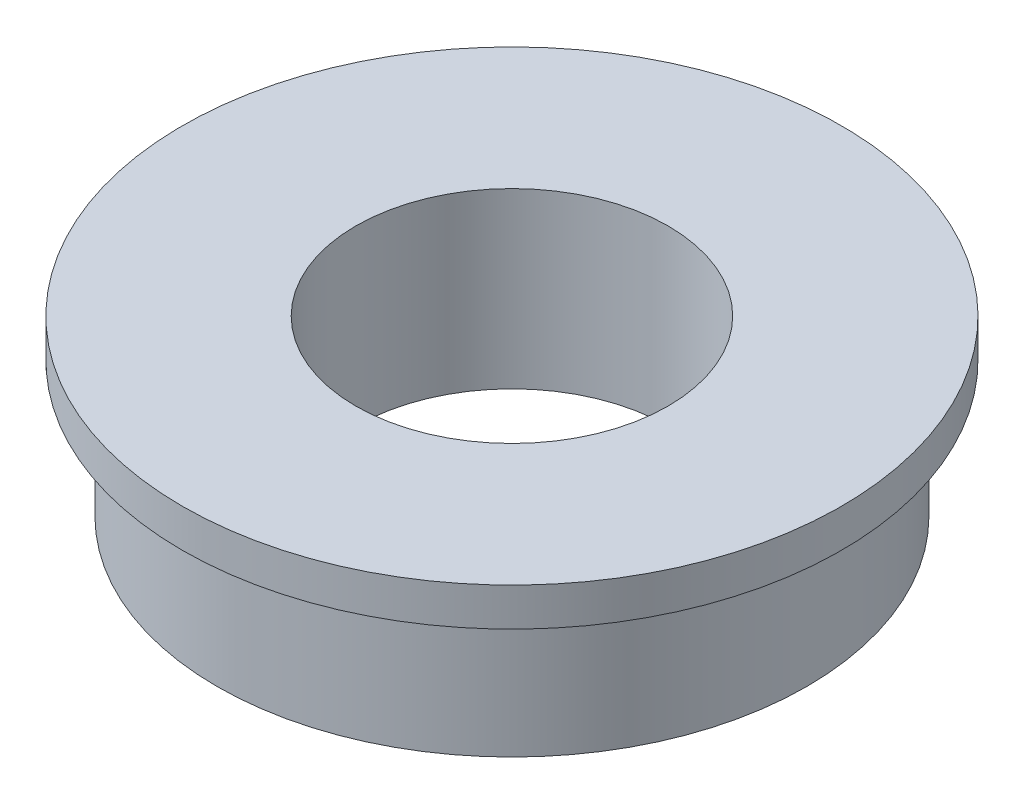
ISO-10303-21;
HEADER;
FILE_DESCRIPTION(('STEP AP214'),'2;1');
FILE_NAME('part.step','',(''),(''),'','','');
FILE_SCHEMA(('AUTOMOTIVE_DESIGN { 1 0 10303 214 1 1 1 1 }'));
ENDSEC;
DATA;
#1=APPLICATION_CONTEXT('core data for automotive mechanical design processes');
#2=APPLICATION_PROTOCOL_DEFINITION('international standard','automotive_design',2000,#1);
#3=PRODUCT_CONTEXT('',#1,'mechanical');
#4=PRODUCT('Part','Part','',(#3));
#5=PRODUCT_RELATED_PRODUCT_CATEGORY('part','',(#4));
#6=PRODUCT_DEFINITION_FORMATION('','',#4);
#7=PRODUCT_DEFINITION_CONTEXT('part definition',#1,'design');
#8=PRODUCT_DEFINITION('design','',#6,#7);
#9=PRODUCT_DEFINITION_SHAPE('','',#8);
#10=(LENGTH_UNIT() NAMED_UNIT(*) SI_UNIT(.MILLI.,.METRE.));
#11=(NAMED_UNIT(*) PLANE_ANGLE_UNIT() SI_UNIT($,.RADIAN.));
#12=(NAMED_UNIT(*) SI_UNIT($,.STERADIAN.) SOLID_ANGLE_UNIT());
#13=UNCERTAINTY_MEASURE_WITH_UNIT(LENGTH_MEASURE(1.E-05),#10,'distance_accuracy_value','');
#14=(GEOMETRIC_REPRESENTATION_CONTEXT(3) GLOBAL_UNCERTAINTY_ASSIGNED_CONTEXT((#13)) GLOBAL_UNIT_ASSIGNED_CONTEXT((#10,
#11,#12)) REPRESENTATION_CONTEXT('',''));
#15=CARTESIAN_POINT('',(0.,0.,0.));
#16=DIRECTION('',(0.,0.,1.));
#17=DIRECTION('',(1.,0.,0.));
#18=AXIS2_PLACEMENT_3D('',#15,#16,#17);
#19=CARTESIAN_POINT('',(0.,5.,0.));
#20=DIRECTION('',(0.,-1.,0.));
#21=DIRECTION('',(0.,0.,-1.));
#22=AXIS2_PLACEMENT_3D('',#19,#20,#21);
#23=CYLINDRICAL_SURFACE('',#22,8.5);
#24=CARTESIAN_POINT('',(0.,0.,0.));
#25=DIRECTION('',(0.,1.,0.));
#26=DIRECTION('',(0.,0.,1.));
#27=AXIS2_PLACEMENT_3D('',#24,#25,#26);
#28=CIRCLE('',#27,8.5);
#29=CARTESIAN_POINT('',(0.,0.,8.5));
#30=VERTEX_POINT('',#29);
#31=EDGE_CURVE('E49',#30,#30,#28,.T.);
#32=ORIENTED_EDGE('',*,*,#31,.T.);
#33=EDGE_LOOP('',(#32));
#34=FACE_BOUND('',#33,.T.);
#35=CARTESIAN_POINT('',(0.,3.9,0.));
#36=DIRECTION('',(0.,1.,0.));
#37=DIRECTION('',(0.,0.,1.));
#38=AXIS2_PLACEMENT_3D('',#35,#36,#37);
#39=CIRCLE('',#38,8.5);
#40=CARTESIAN_POINT('',(0.,3.9,8.5));
#41=VERTEX_POINT('',#40);
#42=EDGE_CURVE('E10',#41,#41,#39,.T.);
#43=ORIENTED_EDGE('',*,*,#42,.F.);
#44=EDGE_LOOP('',(#43));
#45=FACE_BOUND('',#44,.T.);
#46=ADVANCED_FACE('F42',(#34,#45),#23,.T.);
#47=CARTESIAN_POINT('',(0.,5.,0.));
#48=DIRECTION('',(0.,1.,0.));
#49=DIRECTION('',(0.,0.,1.));
#50=AXIS2_PLACEMENT_3D('',#47,#48,#49);
#51=PLANE('',#50);
#52=CARTESIAN_POINT('',(0.,5.,0.));
#53=DIRECTION('',(0.,1.,0.));
#54=DIRECTION('',(0.,0.,1.));
#55=AXIS2_PLACEMENT_3D('',#52,#53,#54);
#56=CIRCLE('',#55,4.5);
#57=CARTESIAN_POINT('',(0.,5.,4.5));
#58=VERTEX_POINT('',#57);
#59=EDGE_CURVE('E54',#58,#58,#56,.T.);
#60=ORIENTED_EDGE('',*,*,#59,.F.);
#61=EDGE_LOOP('',(#60));
#62=FACE_BOUND('',#61,.T.);
#63=CARTESIAN_POINT('',(0.,5.,0.));
#64=DIRECTION('',(0.,1.,0.));
#65=DIRECTION('',(0.,0.,1.));
#66=AXIS2_PLACEMENT_3D('',#63,#64,#65);
#67=CIRCLE('',#66,9.5);
#68=CARTESIAN_POINT('',(0.,5.,9.5));
#69=VERTEX_POINT('',#68);
#70=EDGE_CURVE('E66',#69,#69,#67,.T.);
#71=ORIENTED_EDGE('',*,*,#70,.T.);
#72=EDGE_LOOP('',(#71));
#73=FACE_BOUND('',#72,.T.);
#74=ADVANCED_FACE('F86',(#62,#73),#51,.T.);
#75=CARTESIAN_POINT('',(0.,0.,0.));
#76=DIRECTION('',(0.,1.,0.));
#77=DIRECTION('',(0.,0.,1.));
#78=AXIS2_PLACEMENT_3D('',#75,#76,#77);
#79=PLANE('',#78);
#80=ORIENTED_EDGE('',*,*,#31,.F.);
#81=EDGE_LOOP('',(#80));
#82=FACE_BOUND('',#81,.T.);
#83=CARTESIAN_POINT('',(0.,0.,0.));
#84=DIRECTION('',(0.,1.,0.));
#85=DIRECTION('',(0.,0.,1.));
#86=AXIS2_PLACEMENT_3D('',#83,#84,#85);
#87=CIRCLE('',#86,4.5);
#88=CARTESIAN_POINT('',(0.,0.,4.5));
#89=VERTEX_POINT('',#88);
#90=EDGE_CURVE('E59',#89,#89,#87,.T.);
#91=ORIENTED_EDGE('',*,*,#90,.T.);
#92=EDGE_LOOP('',(#91));
#93=FACE_BOUND('',#92,.T.);
#94=ADVANCED_FACE('F91',(#82,#93),#79,.F.);
#95=CARTESIAN_POINT('',(0.,5.,0.));
#96=DIRECTION('',(0.,-1.,0.));
#97=DIRECTION('',(0.,0.,-1.));
#98=AXIS2_PLACEMENT_3D('',#95,#96,#97);
#99=CYLINDRICAL_SURFACE('',#98,4.5);
#100=ORIENTED_EDGE('',*,*,#59,.T.);
#101=EDGE_LOOP('',(#100));
#102=FACE_BOUND('',#101,.T.);
#103=ORIENTED_EDGE('',*,*,#90,.F.);
#104=EDGE_LOOP('',(#103));
#105=FACE_BOUND('',#104,.T.);
#106=ADVANCED_FACE('F83',(#102,#105),#99,.F.);
#107=CARTESIAN_POINT('',(0.,3.9,0.));
#108=DIRECTION('',(0.,1.,0.));
#109=DIRECTION('',(0.,0.,1.));
#110=AXIS2_PLACEMENT_3D('',#107,#108,#109);
#111=CYLINDRICAL_SURFACE('',#110,9.5);
#112=CARTESIAN_POINT('',(0.,3.9,0.));
#113=DIRECTION('',(0.,1.,0.));
#114=DIRECTION('',(0.,0.,1.));
#115=AXIS2_PLACEMENT_3D('',#112,#113,#114);
#116=CIRCLE('',#115,9.5);
#117=CARTESIAN_POINT('',(0.,3.9,9.5));
#118=VERTEX_POINT('',#117);
#119=EDGE_CURVE('E64',#118,#118,#116,.T.);
#120=ORIENTED_EDGE('',*,*,#119,.T.);
#121=EDGE_LOOP('',(#120));
#122=FACE_BOUND('',#121,.T.);
#123=ORIENTED_EDGE('',*,*,#70,.F.);
#124=EDGE_LOOP('',(#123));
#125=FACE_BOUND('',#124,.T.);
#126=ADVANCED_FACE('F74',(#122,#125),#111,.T.);
#127=CARTESIAN_POINT('',(0.,3.9,0.));
#128=DIRECTION('',(0.,1.,0.));
#129=DIRECTION('',(0.,0.,1.));
#130=AXIS2_PLACEMENT_3D('',#127,#128,#129);
#131=PLANE('',#130);
#132=ORIENTED_EDGE('',*,*,#42,.T.);
#133=EDGE_LOOP('',(#132));
#134=FACE_BOUND('',#133,.T.);
#135=ORIENTED_EDGE('',*,*,#119,.F.);
#136=EDGE_LOOP('',(#135));
#137=FACE_BOUND('',#136,.T.);
#138=ADVANCED_FACE('F77',(#134,#137),#131,.F.);
#139=CLOSED_SHELL('',(#46,#74,#94,#106,#126,#138));
#140=MANIFOLD_SOLID_BREP('B2',#139);
#141=ADVANCED_BREP_SHAPE_REPRESENTATION('',(#18,#140),#14);
#142=SHAPE_DEFINITION_REPRESENTATION(#9,#141);
ENDSEC;
END-ISO-10303-21;
